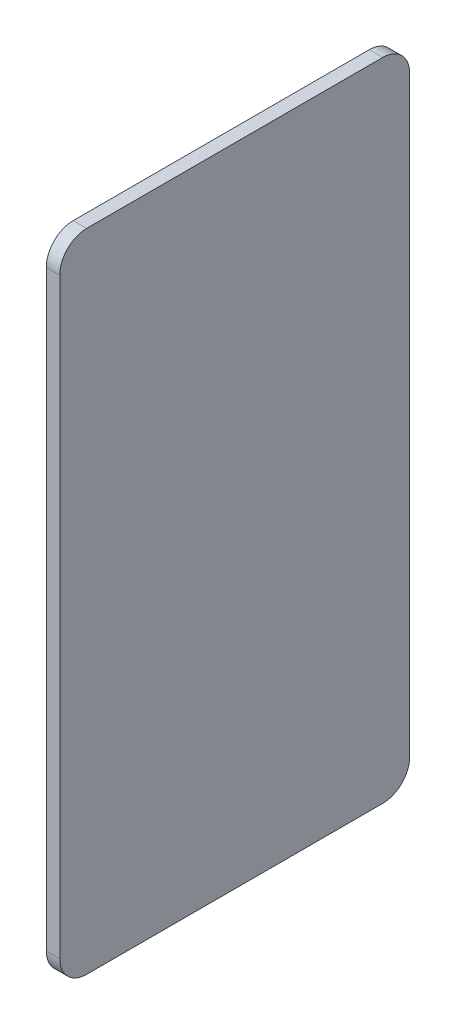
ISO-10303-21;
HEADER;
FILE_DESCRIPTION(('STEP AP214'),'2;1');
FILE_NAME('part.step','',(''),(''),'','','');
FILE_SCHEMA(('AUTOMOTIVE_DESIGN { 1 0 10303 214 1 1 1 1 }'));
ENDSEC;
DATA;
#1=APPLICATION_CONTEXT('core data for automotive mechanical design processes');
#2=APPLICATION_PROTOCOL_DEFINITION('international standard','automotive_design',2000,#1);
#3=PRODUCT_CONTEXT('',#1,'mechanical');
#4=PRODUCT('Part','Part','',(#3));
#5=PRODUCT_RELATED_PRODUCT_CATEGORY('part','',(#4));
#6=PRODUCT_DEFINITION_FORMATION('','',#4);
#7=PRODUCT_DEFINITION_CONTEXT('part definition',#1,'design');
#8=PRODUCT_DEFINITION('design','',#6,#7);
#9=PRODUCT_DEFINITION_SHAPE('','',#8);
#10=(LENGTH_UNIT() NAMED_UNIT(*) SI_UNIT(.MILLI.,.METRE.));
#11=(NAMED_UNIT(*) PLANE_ANGLE_UNIT() SI_UNIT($,.RADIAN.));
#12=(NAMED_UNIT(*) SI_UNIT($,.STERADIAN.) SOLID_ANGLE_UNIT());
#13=UNCERTAINTY_MEASURE_WITH_UNIT(LENGTH_MEASURE(1.E-05),#10,'distance_accuracy_value','');
#14=(GEOMETRIC_REPRESENTATION_CONTEXT(3) GLOBAL_UNCERTAINTY_ASSIGNED_CONTEXT((#13)) GLOBAL_UNIT_ASSIGNED_CONTEXT((#10,
#11,#12)) REPRESENTATION_CONTEXT('',''));
#15=CARTESIAN_POINT('',(0.,0.,0.));
#16=DIRECTION('',(0.,0.,1.));
#17=DIRECTION('',(1.,0.,0.));
#18=AXIS2_PLACEMENT_3D('',#15,#16,#17);
#19=CARTESIAN_POINT('',(153.517331672815,-131.228757923785,-152.73849967394));
#20=DIRECTION('',(0.,0.,-1.));
#21=DIRECTION('',(-1.,0.,0.));
#22=AXIS2_PLACEMENT_3D('',#19,#20,#21);
#23=PLANE('',#22);
#24=DIRECTION('',(0.,1.,0.));
#25=VECTOR('',#24,1.);
#26=CARTESIAN_POINT('',(158.517331672815,-131.228757923785,-152.73849967394));
#27=LINE('',#26,#25);
#28=CARTESIAN_POINT('',(158.517331672815,-121.228757923785,-152.73849967394));
#29=VERTEX_POINT('',#28);
#30=CARTESIAN_POINT('',(158.517331672815,98.7712420762154,-152.73849967394));
#31=VERTEX_POINT('',#30);
#32=EDGE_CURVE('E156',#29,#31,#27,.T.);
#33=ORIENTED_EDGE('',*,*,#32,.F.);
#34=DIRECTION('',(1.,0.,0.));
#35=VECTOR('',#34,1.);
#36=CARTESIAN_POINT('',(153.517331672815,-121.228757923785,-152.73849967394));
#37=LINE('',#36,#35);
#38=CARTESIAN_POINT('',(153.517331672815,-121.228757923785,-152.73849967394));
#39=VERTEX_POINT('',#38);
#40=EDGE_CURVE('E147',#29,#39,#37,.F.);
#41=ORIENTED_EDGE('',*,*,#40,.T.);
#42=DIRECTION('',(0.,1.,0.));
#43=VECTOR('',#42,1.);
#44=CARTESIAN_POINT('',(153.517331672815,-131.228757923785,-152.73849967394));
#45=LINE('',#44,#43);
#46=CARTESIAN_POINT('',(153.517331672815,98.7712420762154,-152.73849967394));
#47=VERTEX_POINT('',#46);
#48=EDGE_CURVE('E153',#39,#47,#45,.T.);
#49=ORIENTED_EDGE('',*,*,#48,.T.);
#50=DIRECTION('',(1.,0.,0.));
#51=VECTOR('',#50,1.);
#52=CARTESIAN_POINT('',(153.517331672815,98.7712420762154,-152.73849967394));
#53=LINE('',#52,#51);
#54=EDGE_CURVE('E144',#47,#31,#53,.T.);
#55=ORIENTED_EDGE('',*,*,#54,.T.);
#56=EDGE_LOOP('',(#33,#41,#49,#55));
#57=FACE_BOUND('',#56,.T.);
#58=ADVANCED_FACE('F33',(#57),#23,.T.);
#59=CARTESIAN_POINT('',(153.517331672815,-131.228757923785,-152.73849967394));
#60=DIRECTION('',(0.,-1.,0.));
#61=DIRECTION('',(0.,0.,-1.));
#62=AXIS2_PLACEMENT_3D('',#59,#60,#61);
#63=PLANE('',#62);
#64=DIRECTION('',(0.,0.,-1.));
#65=VECTOR('',#64,1.);
#66=CARTESIAN_POINT('',(158.517331672815,-131.228757923785,-152.73849967394));
#67=LINE('',#66,#65);
#68=CARTESIAN_POINT('',(158.517331672815,-131.228757923785,-32.7384996739401));
#69=VERTEX_POINT('',#68);
#70=CARTESIAN_POINT('',(158.517331672815,-131.228757923785,-142.73849967394));
#71=VERTEX_POINT('',#70);
#72=EDGE_CURVE('E117',#69,#71,#67,.T.);
#73=ORIENTED_EDGE('',*,*,#72,.F.);
#74=DIRECTION('',(1.,0.,0.));
#75=VECTOR('',#74,1.);
#76=CARTESIAN_POINT('',(153.517331672815,-131.228757923785,-32.7384996739401));
#77=LINE('',#76,#75);
#78=CARTESIAN_POINT('',(153.517331672815,-131.228757923785,-32.7384996739401));
#79=VERTEX_POINT('',#78);
#80=EDGE_CURVE('E135',#69,#79,#77,.F.);
#81=ORIENTED_EDGE('',*,*,#80,.T.);
#82=DIRECTION('',(0.,0.,-1.));
#83=VECTOR('',#82,1.);
#84=CARTESIAN_POINT('',(153.517331672815,-131.228757923785,-152.73849967394));
#85=LINE('',#84,#83);
#86=CARTESIAN_POINT('',(153.517331672815,-131.228757923785,-142.73849967394));
#87=VERTEX_POINT('',#86);
#88=EDGE_CURVE('E120',#79,#87,#85,.T.);
#89=ORIENTED_EDGE('',*,*,#88,.T.);
#90=DIRECTION('',(1.,0.,0.));
#91=VECTOR('',#90,1.);
#92=CARTESIAN_POINT('',(153.517331672815,-131.228757923785,-142.73849967394));
#93=LINE('',#92,#91);
#94=EDGE_CURVE('E132',#87,#71,#93,.T.);
#95=ORIENTED_EDGE('',*,*,#94,.T.);
#96=EDGE_LOOP('',(#73,#81,#89,#95));
#97=FACE_BOUND('',#96,.T.);
#98=ADVANCED_FACE('F169',(#97),#63,.T.);
#99=CARTESIAN_POINT('',(153.517331672815,-131.228757923785,-22.7384996739401));
#100=DIRECTION('',(0.,0.,1.));
#101=DIRECTION('',(1.,0.,0.));
#102=AXIS2_PLACEMENT_3D('',#99,#100,#101);
#103=PLANE('',#102);
#104=DIRECTION('',(0.,-1.,0.));
#105=VECTOR('',#104,1.);
#106=CARTESIAN_POINT('',(153.517331672815,-131.228757923785,-22.7384996739401));
#107=LINE('',#106,#105);
#108=CARTESIAN_POINT('',(153.517331672815,98.7712420762154,-22.7384996739401));
#109=VERTEX_POINT('',#108);
#110=CARTESIAN_POINT('',(153.517331672815,-121.228757923785,-22.7384996739401));
#111=VERTEX_POINT('',#110);
#112=EDGE_CURVE('E124',#109,#111,#107,.T.);
#113=ORIENTED_EDGE('',*,*,#112,.T.);
#114=DIRECTION('',(1.,0.,0.));
#115=VECTOR('',#114,1.);
#116=CARTESIAN_POINT('',(153.517331672815,-121.228757923785,-22.7384996739401));
#117=LINE('',#116,#115);
#118=CARTESIAN_POINT('',(158.517331672815,-121.228757923785,-22.7384996739401));
#119=VERTEX_POINT('',#118);
#120=EDGE_CURVE('E116',#111,#119,#117,.T.);
#121=ORIENTED_EDGE('',*,*,#120,.T.);
#122=DIRECTION('',(0.,-1.,0.));
#123=VECTOR('',#122,1.);
#124=CARTESIAN_POINT('',(158.517331672815,-131.228757923785,-22.7384996739401));
#125=LINE('',#124,#123);
#126=CARTESIAN_POINT('',(158.517331672815,98.7712420762154,-22.7384996739401));
#127=VERTEX_POINT('',#126);
#128=EDGE_CURVE('E102',#127,#119,#125,.T.);
#129=ORIENTED_EDGE('',*,*,#128,.F.);
#130=DIRECTION('',(1.,0.,0.));
#131=VECTOR('',#130,1.);
#132=CARTESIAN_POINT('',(153.517331672815,98.7712420762154,-22.7384996739401));
#133=LINE('',#132,#131);
#134=EDGE_CURVE('E114',#127,#109,#133,.F.);
#135=ORIENTED_EDGE('',*,*,#134,.T.);
#136=EDGE_LOOP('',(#113,#121,#129,#135));
#137=FACE_BOUND('',#136,.T.);
#138=ADVANCED_FACE('F113',(#137),#103,.T.);
#139=CARTESIAN_POINT('',(153.517331672815,108.771242076215,-152.73849967394));
#140=DIRECTION('',(0.,1.,0.));
#141=DIRECTION('',(0.,0.,1.));
#142=AXIS2_PLACEMENT_3D('',#139,#140,#141);
#143=PLANE('',#142);
#144=DIRECTION('',(0.,0.,1.));
#145=VECTOR('',#144,1.);
#146=CARTESIAN_POINT('',(153.517331672815,108.771242076215,-152.73849967394));
#147=LINE('',#146,#145);
#148=CARTESIAN_POINT('',(153.517331672815,108.771242076215,-142.73849967394));
#149=VERTEX_POINT('',#148);
#150=CARTESIAN_POINT('',(153.517331672815,108.771242076215,-32.7384996739401));
#151=VERTEX_POINT('',#150);
#152=EDGE_CURVE('E162',#149,#151,#147,.T.);
#153=ORIENTED_EDGE('',*,*,#152,.T.);
#154=DIRECTION('',(1.,0.,0.));
#155=VECTOR('',#154,1.);
#156=CARTESIAN_POINT('',(153.517331672815,108.771242076215,-32.7384996739401));
#157=LINE('',#156,#155);
#158=CARTESIAN_POINT('',(158.517331672815,108.771242076215,-32.7384996739401));
#159=VERTEX_POINT('',#158);
#160=EDGE_CURVE('E11',#151,#159,#157,.T.);
#161=ORIENTED_EDGE('',*,*,#160,.T.);
#162=DIRECTION('',(0.,0.,1.));
#163=VECTOR('',#162,1.);
#164=CARTESIAN_POINT('',(158.517331672815,108.771242076215,-152.73849967394));
#165=LINE('',#164,#163);
#166=CARTESIAN_POINT('',(158.517331672815,108.771242076215,-142.73849967394));
#167=VERTEX_POINT('',#166);
#168=EDGE_CURVE('E103',#167,#159,#165,.T.);
#169=ORIENTED_EDGE('',*,*,#168,.F.);
#170=DIRECTION('',(1.,0.,0.));
#171=VECTOR('',#170,1.);
#172=CARTESIAN_POINT('',(153.517331672815,108.771242076215,-142.73849967394));
#173=LINE('',#172,#171);
#174=EDGE_CURVE('E41',#167,#149,#173,.F.);
#175=ORIENTED_EDGE('',*,*,#174,.T.);
#176=EDGE_LOOP('',(#153,#161,#169,#175));
#177=FACE_BOUND('',#176,.T.);
#178=ADVANCED_FACE('F179',(#177),#143,.T.);
#179=CARTESIAN_POINT('',(153.517331672815,0.,0.));
#180=DIRECTION('',(1.,0.,0.));
#181=DIRECTION('',(0.,0.,-1.));
#182=AXIS2_PLACEMENT_3D('',#179,#180,#181);
#183=PLANE('',#182);
#184=ORIENTED_EDGE('',*,*,#88,.F.);
#185=CARTESIAN_POINT('',(153.517331672815,-121.228757923785,-32.7384996739401));
#186=DIRECTION('',(1.,0.,0.));
#187=DIRECTION('',(0.,0.,-1.));
#188=AXIS2_PLACEMENT_3D('',#185,#186,#187);
#189=CIRCLE('',#188,10.);
#190=EDGE_CURVE('E142',#79,#111,#189,.F.);
#191=ORIENTED_EDGE('',*,*,#190,.T.);
#192=ORIENTED_EDGE('',*,*,#112,.F.);
#193=CARTESIAN_POINT('',(153.517331672815,98.7712420762154,-32.7384996739401));
#194=DIRECTION('',(1.,0.,0.));
#195=DIRECTION('',(0.,0.,-1.));
#196=AXIS2_PLACEMENT_3D('',#193,#194,#195);
#197=CIRCLE('',#196,10.);
#198=EDGE_CURVE('E48',#109,#151,#197,.F.);
#199=ORIENTED_EDGE('',*,*,#198,.T.);
#200=ORIENTED_EDGE('',*,*,#152,.F.);
#201=CARTESIAN_POINT('',(153.517331672815,98.7712420762154,-142.73849967394));
#202=DIRECTION('',(1.,0.,0.));
#203=DIRECTION('',(0.,0.,-1.));
#204=AXIS2_PLACEMENT_3D('',#201,#202,#203);
#205=CIRCLE('',#204,10.);
#206=EDGE_CURVE('E137',#149,#47,#205,.F.);
#207=ORIENTED_EDGE('',*,*,#206,.T.);
#208=ORIENTED_EDGE('',*,*,#48,.F.);
#209=CARTESIAN_POINT('',(153.517331672815,-121.228757923785,-142.73849967394));
#210=DIRECTION('',(1.,0.,0.));
#211=DIRECTION('',(0.,0.,-1.));
#212=AXIS2_PLACEMENT_3D('',#209,#210,#211);
#213=CIRCLE('',#212,10.);
#214=EDGE_CURVE('E140',#39,#87,#213,.F.);
#215=ORIENTED_EDGE('',*,*,#214,.T.);
#216=EDGE_LOOP('',(#184,#191,#192,#199,#200,#207,#208,#215));
#217=FACE_BOUND('',#216,.T.);
#218=ADVANCED_FACE('F160',(#217),#183,.F.);
#219=CARTESIAN_POINT('',(158.517331672815,0.,0.));
#220=DIRECTION('',(1.,0.,0.));
#221=DIRECTION('',(0.,0.,-1.));
#222=AXIS2_PLACEMENT_3D('',#219,#220,#221);
#223=PLANE('',#222);
#224=ORIENTED_EDGE('',*,*,#128,.T.);
#225=CARTESIAN_POINT('',(158.517331672815,-121.228757923785,-32.7384996739401));
#226=DIRECTION('',(1.,0.,0.));
#227=DIRECTION('',(0.,0.,-1.));
#228=AXIS2_PLACEMENT_3D('',#225,#226,#227);
#229=CIRCLE('',#228,10.);
#230=EDGE_CURVE('E130',#119,#69,#229,.T.);
#231=ORIENTED_EDGE('',*,*,#230,.T.);
#232=ORIENTED_EDGE('',*,*,#72,.T.);
#233=CARTESIAN_POINT('',(158.517331672815,-121.228757923785,-142.73849967394));
#234=DIRECTION('',(1.,0.,0.));
#235=DIRECTION('',(0.,0.,-1.));
#236=AXIS2_PLACEMENT_3D('',#233,#234,#235);
#237=CIRCLE('',#236,10.);
#238=EDGE_CURVE('E107',#71,#29,#237,.T.);
#239=ORIENTED_EDGE('',*,*,#238,.T.);
#240=ORIENTED_EDGE('',*,*,#32,.T.);
#241=CARTESIAN_POINT('',(158.517331672815,98.7712420762154,-142.73849967394));
#242=DIRECTION('',(1.,0.,0.));
#243=DIRECTION('',(0.,0.,-1.));
#244=AXIS2_PLACEMENT_3D('',#241,#242,#243);
#245=CIRCLE('',#244,10.);
#246=EDGE_CURVE('E108',#31,#167,#245,.T.);
#247=ORIENTED_EDGE('',*,*,#246,.T.);
#248=ORIENTED_EDGE('',*,*,#168,.T.);
#249=CARTESIAN_POINT('',(158.517331672815,98.7712420762154,-32.7384996739401));
#250=DIRECTION('',(1.,0.,0.));
#251=DIRECTION('',(0.,0.,-1.));
#252=AXIS2_PLACEMENT_3D('',#249,#250,#251);
#253=CIRCLE('',#252,10.);
#254=EDGE_CURVE('E99',#159,#127,#253,.T.);
#255=ORIENTED_EDGE('',*,*,#254,.T.);
#256=EDGE_LOOP('',(#224,#231,#232,#239,#240,#247,#248,#255));
#257=FACE_BOUND('',#256,.T.);
#258=ADVANCED_FACE('F101',(#257),#223,.T.);
#259=CARTESIAN_POINT('',(153.517331672815,-121.228757923785,-32.7384996739401));
#260=DIRECTION('',(1.,0.,0.));
#261=DIRECTION('',(0.,0.,-1.));
#262=AXIS2_PLACEMENT_3D('',#259,#260,#261);
#263=CYLINDRICAL_SURFACE('',#262,10.);
#264=ORIENTED_EDGE('',*,*,#190,.F.);
#265=ORIENTED_EDGE('',*,*,#80,.F.);
#266=ORIENTED_EDGE('',*,*,#230,.F.);
#267=ORIENTED_EDGE('',*,*,#120,.F.);
#268=EDGE_LOOP('',(#264,#265,#266,#267));
#269=FACE_BOUND('',#268,.T.);
#270=ADVANCED_FACE('F173',(#269),#263,.T.);
#271=CARTESIAN_POINT('',(153.517331672815,-121.228757923785,-142.73849967394));
#272=DIRECTION('',(1.,0.,0.));
#273=DIRECTION('',(0.,0.,-1.));
#274=AXIS2_PLACEMENT_3D('',#271,#272,#273);
#275=CYLINDRICAL_SURFACE('',#274,10.);
#276=ORIENTED_EDGE('',*,*,#214,.F.);
#277=ORIENTED_EDGE('',*,*,#40,.F.);
#278=ORIENTED_EDGE('',*,*,#238,.F.);
#279=ORIENTED_EDGE('',*,*,#94,.F.);
#280=EDGE_LOOP('',(#276,#277,#278,#279));
#281=FACE_BOUND('',#280,.T.);
#282=ADVANCED_FACE('F165',(#281),#275,.T.);
#283=CARTESIAN_POINT('',(153.517331672815,98.7712420762154,-32.7384996739401));
#284=DIRECTION('',(1.,0.,0.));
#285=DIRECTION('',(0.,0.,-1.));
#286=AXIS2_PLACEMENT_3D('',#283,#284,#285);
#287=CYLINDRICAL_SURFACE('',#286,10.);
#288=ORIENTED_EDGE('',*,*,#198,.F.);
#289=ORIENTED_EDGE('',*,*,#134,.F.);
#290=ORIENTED_EDGE('',*,*,#254,.F.);
#291=ORIENTED_EDGE('',*,*,#160,.F.);
#292=EDGE_LOOP('',(#288,#289,#290,#291));
#293=FACE_BOUND('',#292,.T.);
#294=ADVANCED_FACE('F119',(#293),#287,.T.);
#295=CARTESIAN_POINT('',(153.517331672815,98.7712420762154,-142.73849967394));
#296=DIRECTION('',(1.,0.,0.));
#297=DIRECTION('',(0.,0.,-1.));
#298=AXIS2_PLACEMENT_3D('',#295,#296,#297);
#299=CYLINDRICAL_SURFACE('',#298,10.);
#300=ORIENTED_EDGE('',*,*,#206,.F.);
#301=ORIENTED_EDGE('',*,*,#174,.F.);
#302=ORIENTED_EDGE('',*,*,#246,.F.);
#303=ORIENTED_EDGE('',*,*,#54,.F.);
#304=EDGE_LOOP('',(#300,#301,#302,#303));
#305=FACE_BOUND('',#304,.T.);
#306=ADVANCED_FACE('F35',(#305),#299,.T.);
#307=CLOSED_SHELL('',(#58,#98,#138,#178,#218,#258,#270,#282,#294,#306));
#308=MANIFOLD_SOLID_BREP('B2',#307);
#309=ADVANCED_BREP_SHAPE_REPRESENTATION('',(#18,#308),#14);
#310=SHAPE_DEFINITION_REPRESENTATION(#9,#309);
ENDSEC;
END-ISO-10303-21;
